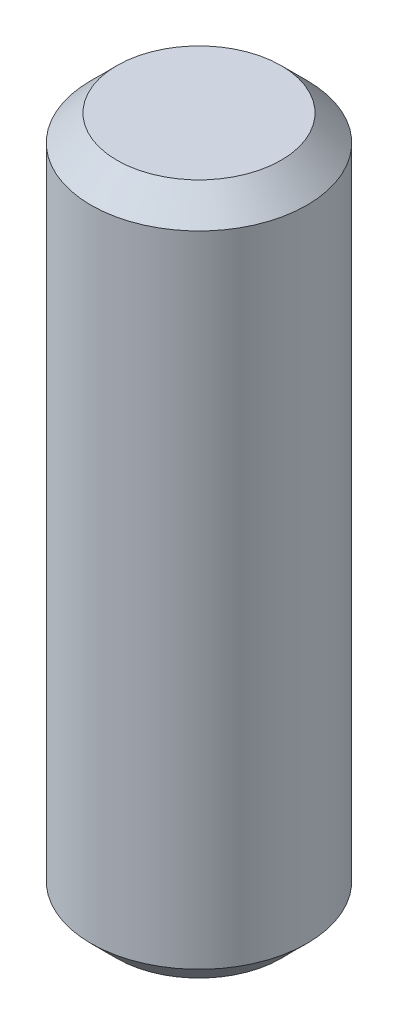
ISO-10303-21;
HEADER;
FILE_DESCRIPTION(('STEP AP214'),'2;1');
FILE_NAME('part.step','',(''),(''),'','','');
FILE_SCHEMA(('AUTOMOTIVE_DESIGN { 1 0 10303 214 1 1 1 1 }'));
ENDSEC;
DATA;
#1=APPLICATION_CONTEXT('core data for automotive mechanical design processes');
#2=APPLICATION_PROTOCOL_DEFINITION('international standard','automotive_design',2000,#1);
#3=PRODUCT_CONTEXT('',#1,'mechanical');
#4=PRODUCT('Part','Part','',(#3));
#5=PRODUCT_RELATED_PRODUCT_CATEGORY('part','',(#4));
#6=PRODUCT_DEFINITION_FORMATION('','',#4);
#7=PRODUCT_DEFINITION_CONTEXT('part definition',#1,'design');
#8=PRODUCT_DEFINITION('design','',#6,#7);
#9=PRODUCT_DEFINITION_SHAPE('','',#8);
#10=(LENGTH_UNIT() NAMED_UNIT(*) SI_UNIT(.MILLI.,.METRE.));
#11=(NAMED_UNIT(*) PLANE_ANGLE_UNIT() SI_UNIT($,.RADIAN.));
#12=(NAMED_UNIT(*) SI_UNIT($,.STERADIAN.) SOLID_ANGLE_UNIT());
#13=UNCERTAINTY_MEASURE_WITH_UNIT(LENGTH_MEASURE(1.E-05),#10,'distance_accuracy_value','');
#14=(GEOMETRIC_REPRESENTATION_CONTEXT(3) GLOBAL_UNCERTAINTY_ASSIGNED_CONTEXT((#13)) GLOBAL_UNIT_ASSIGNED_CONTEXT((#10,
#11,#12)) REPRESENTATION_CONTEXT('',''));
#15=CARTESIAN_POINT('',(0.,0.,0.));
#16=DIRECTION('',(0.,0.,1.));
#17=DIRECTION('',(1.,0.,0.));
#18=AXIS2_PLACEMENT_3D('',#15,#16,#17);
#19=CARTESIAN_POINT('',(0.,40.64,0.));
#20=DIRECTION('',(0.,-1.,0.));
#21=DIRECTION('',(0.,0.,-1.));
#22=AXIS2_PLACEMENT_3D('',#19,#20,#21);
#23=CYLINDRICAL_SURFACE('',#22,6.35);
#24=CARTESIAN_POINT('',(0.,1.52399999999999,0.));
#25=DIRECTION('',(0.,1.,0.));
#26=DIRECTION('',(0.,0.,1.));
#27=AXIS2_PLACEMENT_3D('',#24,#25,#26);
#28=CIRCLE('',#27,6.35);
#29=CARTESIAN_POINT('',(0.,1.52399999999999,6.35));
#30=VERTEX_POINT('',#29);
#31=EDGE_CURVE('E53',#30,#30,#28,.T.);
#32=ORIENTED_EDGE('',*,*,#31,.T.);
#33=EDGE_LOOP('',(#32));
#34=FACE_BOUND('',#33,.T.);
#35=CARTESIAN_POINT('',(0.,39.116,0.));
#36=DIRECTION('',(0.,1.,0.));
#37=DIRECTION('',(0.,0.,1.));
#38=AXIS2_PLACEMENT_3D('',#35,#36,#37);
#39=CIRCLE('',#38,6.35);
#40=CARTESIAN_POINT('',(0.,39.116,6.35));
#41=VERTEX_POINT('',#40);
#42=EDGE_CURVE('E58',#41,#41,#39,.F.);
#43=ORIENTED_EDGE('',*,*,#42,.T.);
#44=EDGE_LOOP('',(#43));
#45=FACE_BOUND('',#44,.T.);
#46=ADVANCED_FACE('F39',(#34,#45),#23,.T.);
#47=CARTESIAN_POINT('',(0.,40.64,0.));
#48=DIRECTION('',(0.,1.,0.));
#49=DIRECTION('',(0.,0.,1.));
#50=AXIS2_PLACEMENT_3D('',#47,#48,#49);
#51=PLANE('',#50);
#52=CARTESIAN_POINT('',(0.,40.64,0.));
#53=DIRECTION('',(0.,1.,0.));
#54=DIRECTION('',(0.,0.,1.));
#55=AXIS2_PLACEMENT_3D('',#52,#53,#54);
#56=CIRCLE('',#55,4.82600000000001);
#57=CARTESIAN_POINT('',(0.,40.64,4.82600000000001));
#58=VERTEX_POINT('',#57);
#59=EDGE_CURVE('E10',#58,#58,#56,.T.);
#60=ORIENTED_EDGE('',*,*,#59,.T.);
#61=EDGE_LOOP('',(#60));
#62=FACE_BOUND('',#61,.T.);
#63=ADVANCED_FACE('F75',(#62),#51,.T.);
#64=CARTESIAN_POINT('',(0.,0.,0.));
#65=DIRECTION('',(0.,1.,0.));
#66=DIRECTION('',(0.,0.,1.));
#67=AXIS2_PLACEMENT_3D('',#64,#65,#66);
#68=PLANE('',#67);
#69=CARTESIAN_POINT('',(0.,0.,0.));
#70=DIRECTION('',(0.,1.,0.));
#71=DIRECTION('',(0.,0.,1.));
#72=AXIS2_PLACEMENT_3D('',#69,#70,#71);
#73=CIRCLE('',#72,4.82600000000001);
#74=CARTESIAN_POINT('',(0.,0.,4.82600000000001));
#75=VERTEX_POINT('',#74);
#76=EDGE_CURVE('E48',#75,#75,#73,.F.);
#77=ORIENTED_EDGE('',*,*,#76,.T.);
#78=EDGE_LOOP('',(#77));
#79=FACE_BOUND('',#78,.T.);
#80=ADVANCED_FACE('F72',(#79),#68,.F.);
#81=CARTESIAN_POINT('',(0.,1.52399999999999,0.));
#82=DIRECTION('',(0.,1.,0.));
#83=DIRECTION('',(0.,0.,1.));
#84=AXIS2_PLACEMENT_3D('',#81,#82,#83);
#85=CONICAL_SURFACE('',#84,6.35,0.785398163397447);
#86=ORIENTED_EDGE('',*,*,#76,.F.);
#87=EDGE_LOOP('',(#86));
#88=FACE_BOUND('',#87,.T.);
#89=ORIENTED_EDGE('',*,*,#31,.F.);
#90=EDGE_LOOP('',(#89));
#91=FACE_BOUND('',#90,.T.);
#92=ADVANCED_FACE('F68',(#88,#91),#85,.T.);
#93=CARTESIAN_POINT('',(0.,40.64,0.));
#94=DIRECTION('',(0.,-1.,0.));
#95=DIRECTION('',(0.,0.,-1.));
#96=AXIS2_PLACEMENT_3D('',#93,#94,#95);
#97=CONICAL_SURFACE('',#96,4.82600000000001,0.785398163397445);
#98=ORIENTED_EDGE('',*,*,#42,.F.);
#99=EDGE_LOOP('',(#98));
#100=FACE_BOUND('',#99,.T.);
#101=ORIENTED_EDGE('',*,*,#59,.F.);
#102=EDGE_LOOP('',(#101));
#103=FACE_BOUND('',#102,.T.);
#104=ADVANCED_FACE('F42',(#100,#103),#97,.T.);
#105=CLOSED_SHELL('',(#46,#63,#80,#92,#104));
#106=MANIFOLD_SOLID_BREP('B2',#105);
#107=ADVANCED_BREP_SHAPE_REPRESENTATION('',(#18,#106),#14);
#108=SHAPE_DEFINITION_REPRESENTATION(#9,#107);
ENDSEC;
END-ISO-10303-21;
